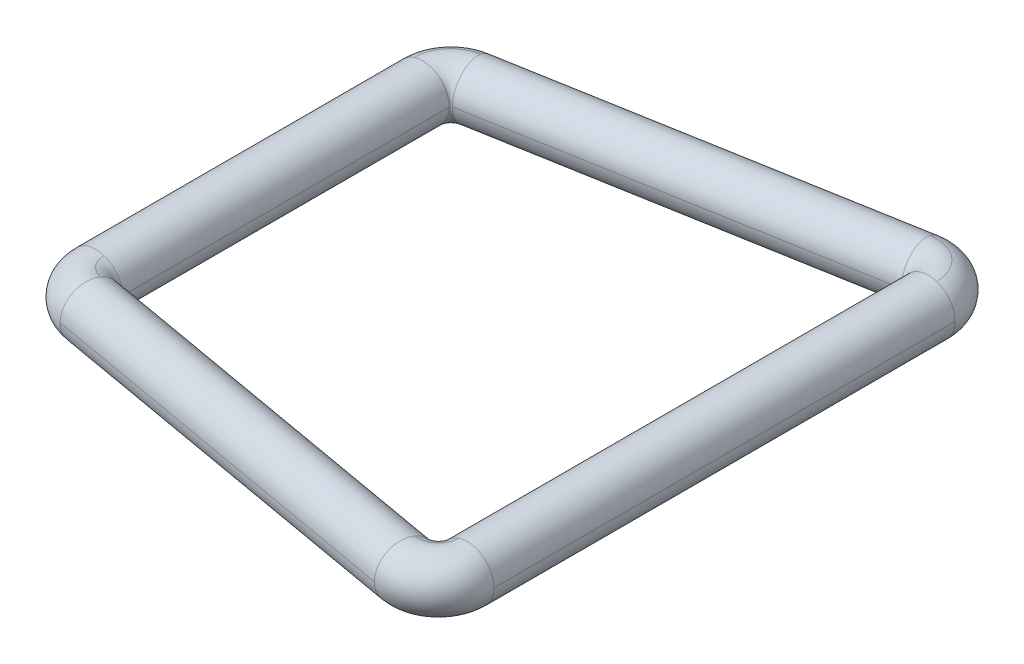
ISO-10303-21;
HEADER;
FILE_DESCRIPTION(('STEP AP214'),'2;1');
FILE_NAME('part.step','',(''),(''),'','','');
FILE_SCHEMA(('AUTOMOTIVE_DESIGN { 1 0 10303 214 1 1 1 1 }'));
ENDSEC;
DATA;
#1=APPLICATION_CONTEXT('core data for automotive mechanical design processes');
#2=APPLICATION_PROTOCOL_DEFINITION('international standard','automotive_design',2000,#1);
#3=PRODUCT_CONTEXT('',#1,'mechanical');
#4=PRODUCT('Part','Part','',(#3));
#5=PRODUCT_RELATED_PRODUCT_CATEGORY('part','',(#4));
#6=PRODUCT_DEFINITION_FORMATION('','',#4);
#7=PRODUCT_DEFINITION_CONTEXT('part definition',#1,'design');
#8=PRODUCT_DEFINITION('design','',#6,#7);
#9=PRODUCT_DEFINITION_SHAPE('','',#8);
#10=(LENGTH_UNIT() NAMED_UNIT(*) SI_UNIT(.MILLI.,.METRE.));
#11=(NAMED_UNIT(*) PLANE_ANGLE_UNIT() SI_UNIT($,.RADIAN.));
#12=(NAMED_UNIT(*) SI_UNIT($,.STERADIAN.) SOLID_ANGLE_UNIT());
#13=UNCERTAINTY_MEASURE_WITH_UNIT(LENGTH_MEASURE(1.E-05),#10,'distance_accuracy_value','');
#14=(GEOMETRIC_REPRESENTATION_CONTEXT(3) GLOBAL_UNCERTAINTY_ASSIGNED_CONTEXT((#13)) GLOBAL_UNIT_ASSIGNED_CONTEXT((#10,
#11,#12)) REPRESENTATION_CONTEXT('',''));
#15=CARTESIAN_POINT('',(0.,0.,0.));
#16=DIRECTION('',(0.,0.,1.));
#17=DIRECTION('',(1.,0.,0.));
#18=AXIS2_PLACEMENT_3D('',#15,#16,#17);
#19=CARTESIAN_POINT('',(13.36,0.,12.9));
#20=DIRECTION('',(0.,0.,-1.));
#21=DIRECTION('',(0.,1.,0.));
#22=AXIS2_PLACEMENT_3D('',#19,#20,#21);
#23=CYLINDRICAL_SURFACE('',#22,1.5);
#24=DIRECTION('',(0.,0.,-1.));
#25=VECTOR('',#24,1.);
#26=CARTESIAN_POINT('',(14.86,0.,12.9));
#27=LINE('',#26,#25);
#28=CARTESIAN_POINT('',(14.86,0.,12.9));
#29=VERTEX_POINT('',#28);
#30=CARTESIAN_POINT('',(14.86,0.,-12.9));
#31=VERTEX_POINT('',#30);
#32=EDGE_CURVE('E11',#29,#31,#27,.T.);
#33=ORIENTED_EDGE('',*,*,#32,.F.);
#34=CARTESIAN_POINT('',(13.36,0.,12.9));
#35=DIRECTION('',(0.,0.,1.));
#36=DIRECTION('',(1.,0.,0.));
#37=AXIS2_PLACEMENT_3D('',#34,#35,#36);
#38=CIRCLE('',#37,1.5);
#39=CARTESIAN_POINT('',(13.8235254915624,-1.42658477444273,12.9));
#40=VERTEX_POINT('',#39);
#41=EDGE_CURVE('E26',#40,#29,#38,.T.);
#42=ORIENTED_EDGE('',*,*,#41,.F.);
#43=CARTESIAN_POINT('',(13.36,0.,12.9));
#44=DIRECTION('',(0.,0.,1.));
#45=DIRECTION('',(1.,0.,0.));
#46=AXIS2_PLACEMENT_3D('',#43,#44,#45);
#47=CIRCLE('',#46,1.5);
#48=CARTESIAN_POINT('',(11.86,0.,12.9));
#49=VERTEX_POINT('',#48);
#50=EDGE_CURVE('E572',#49,#40,#47,.T.);
#51=ORIENTED_EDGE('',*,*,#50,.F.);
#52=DIRECTION('',(0.,0.,-1.));
#53=VECTOR('',#52,1.);
#54=CARTESIAN_POINT('',(11.86,0.,12.9));
#55=LINE('',#54,#53);
#56=CARTESIAN_POINT('',(11.86,0.,-12.9));
#57=VERTEX_POINT('',#56);
#58=EDGE_CURVE('E567',#49,#57,#55,.T.);
#59=ORIENTED_EDGE('',*,*,#58,.T.);
#60=CARTESIAN_POINT('',(13.36,0.,-12.9));
#61=DIRECTION('',(0.,0.,1.));
#62=DIRECTION('',(1.,0.,0.));
#63=AXIS2_PLACEMENT_3D('',#60,#61,#62);
#64=CIRCLE('',#63,1.5);
#65=CARTESIAN_POINT('',(12.8964745084376,-1.42658477444273,-12.9));
#66=VERTEX_POINT('',#65);
#67=EDGE_CURVE('E554',#57,#66,#64,.T.);
#68=ORIENTED_EDGE('',*,*,#67,.T.);
#69=CARTESIAN_POINT('',(13.36,0.,-12.9));
#70=DIRECTION('',(0.,0.,1.));
#71=DIRECTION('',(1.,0.,0.));
#72=AXIS2_PLACEMENT_3D('',#69,#70,#71);
#73=CIRCLE('',#72,1.5);
#74=EDGE_CURVE('E549',#66,#31,#73,.T.);
#75=ORIENTED_EDGE('',*,*,#74,.T.);
#76=EDGE_LOOP('',(#33,#42,#51,#59,#68,#75));
#77=FACE_BOUND('',#76,.T.);
#78=ADVANCED_FACE('F17',(#77),#23,.T.);
#79=CARTESIAN_POINT('',(11.76,0.,-12.9));
#80=DIRECTION('',(0.,1.,0.));
#81=DIRECTION('',(-0.642787609686501,0.,0.766044443119011));
#82=AXIS2_PLACEMENT_3D('',#79,#80,#81);
#83=TOROIDAL_SURFACE('',#82,1.6,1.5);
#84=CARTESIAN_POINT('',(11.76,-1.42658477444273,-12.9));
#85=DIRECTION('',(0.,1.,0.));
#86=DIRECTION('',(1.,0.,0.));
#87=AXIS2_PLACEMENT_3D('',#84,#85,#86);
#88=CIRCLE('',#87,1.13647450843758);
#89=CARTESIAN_POINT('',(11.5626532726448,-1.42658477444273,-14.01920890701));
#90=VERTEX_POINT('',#89);
#91=EDGE_CURVE('E547',#66,#90,#88,.T.);
#92=ORIENTED_EDGE('',*,*,#91,.T.);
#93=CARTESIAN_POINT('',(11.4821629157329,0.,-14.4756924048195));
#94=DIRECTION('',(-0.984807753012208,0.,0.17364817766693));
#95=DIRECTION('',(0.17364817766693,0.,0.984807753012208));
#96=AXIS2_PLACEMENT_3D('',#93,#94,#95);
#97=CIRCLE('',#96,1.5);
#98=CARTESIAN_POINT('',(11.2216906492324,0.,-15.9529040343383));
#99=VERTEX_POINT('',#98);
#100=EDGE_CURVE('E169',#99,#90,#97,.T.);
#101=ORIENTED_EDGE('',*,*,#100,.F.);
#102=CARTESIAN_POINT('',(11.4821629157329,0.,-14.4756924048195));
#103=DIRECTION('',(-0.984807753012208,0.,0.17364817766693));
#104=DIRECTION('',(0.17364817766693,0.,0.984807753012208));
#105=AXIS2_PLACEMENT_3D('',#102,#103,#104);
#106=CIRCLE('',#105,1.5);
#107=CARTESIAN_POINT('',(11.4016725588207,1.42658477444273,-14.932175902629));
#108=VERTEX_POINT('',#107);
#109=EDGE_CURVE('E556',#108,#99,#106,.T.);
#110=ORIENTED_EDGE('',*,*,#109,.F.);
#111=CARTESIAN_POINT('',(13.8235254915624,1.42658477444273,-12.9));
#112=CARTESIAN_POINT('',(13.823526582896,1.42658477444273,-12.9375160098481));
#113=CARTESIAN_POINT('',(13.8225024414523,1.42658477444273,-12.975031916497));
#114=CARTESIAN_POINT('',(13.8184115299439,1.42658477444273,-13.0499522110827));
#115=CARTESIAN_POINT('',(13.8153447598793,1.42658477444273,-13.0873565990196));
#116=CARTESIAN_POINT('',(13.8071764280626,1.42658477444273,-13.1619425438679));
#117=CARTESIAN_POINT('',(13.8020748663106,1.42658477444273,-13.1991241007793));
#118=CARTESIAN_POINT('',(13.7898524673639,1.42658477444273,-13.2731538228404));
#119=CARTESIAN_POINT('',(13.7827316301691,1.42658477444273,-13.3100019879901));
#120=CARTESIAN_POINT('',(13.7664917658361,1.42658477444273,-13.3832553335004));
#121=CARTESIAN_POINT('',(13.7573727386978,1.42658477444273,-13.419660513861));
#122=CARTESIAN_POINT('',(13.7371636395456,1.42658477444273,-13.4919196206017));
#123=CARTESIAN_POINT('',(13.7260735675316,1.42658477444273,-13.5277735469817));
#124=CARTESIAN_POINT('',(13.7019553543517,1.42658477444273,-13.5988235143129));
#125=CARTESIAN_POINT('',(13.6889272131858,1.42658477444273,-13.6340195552639));
#126=CARTESIAN_POINT('',(13.6609716097157,1.42658477444273,-13.7036490773255));
#127=CARTESIAN_POINT('',(13.6460441474116,1.42658477444273,-13.738082558436));
#128=CARTESIAN_POINT('',(13.6143342960917,1.42658477444273,-13.8060845541675));
#129=CARTESIAN_POINT('',(13.5975519070759,1.42658477444273,-13.8396530687884));
#130=CARTESIAN_POINT('',(13.5621821139917,1.42658477444273,-13.9058252973712));
#131=CARTESIAN_POINT('',(13.5435947099233,1.42658477444273,-13.9384290113331));
#132=CARTESIAN_POINT('',(13.5046701664225,1.42658477444273,-14.0025746737773));
#133=CARTESIAN_POINT('',(13.4843330269901,1.42658477444273,-14.0341166222596));
#134=CARTESIAN_POINT('',(13.4419694962796,1.42658477444273,-14.0960449466619));
#135=CARTESIAN_POINT('',(13.4199431050015,1.42658477444273,-14.1264313225818));
#136=CARTESIAN_POINT('',(13.3742665780127,1.42658477444273,-14.1859581314973));
#137=CARTESIAN_POINT('',(13.350616442302,1.42658477444273,-14.2150985644928));
#138=CARTESIAN_POINT('',(13.3017627629483,1.42658477444273,-14.2720468226844));
#139=CARTESIAN_POINT('',(13.2765592193053,1.42658477444273,-14.2998546478804));
#140=CARTESIAN_POINT('',(13.2246736804873,1.42658477444273,-14.3540549888296));
#141=CARTESIAN_POINT('',(13.1979916853122,1.42658477444273,-14.3804475045827));
#142=CARTESIAN_POINT('',(13.1432285968077,1.42658477444273,-14.4317387341925));
#143=CARTESIAN_POINT('',(13.1151475034782,1.42658477444273,-14.4566374480492));
#144=CARTESIAN_POINT('',(13.057669733019,1.42658477444273,-14.5048670240424));
#145=CARTESIAN_POINT('',(13.0282730558893,1.42658477444273,-14.5281978861789));
#146=CARTESIAN_POINT('',(12.9682515447858,1.42658477444273,-14.573222371765));
#147=CARTESIAN_POINT('',(12.937626710812,1.42658477444273,-14.5949159952147));
#148=CARTESIAN_POINT('',(12.8752399655663,1.42658477444273,-14.6366014856771));
#149=CARTESIAN_POINT('',(12.8434780542945,1.42658477444273,-14.6565933526899));
#150=CARTESIAN_POINT('',(12.7789116157148,1.42658477444273,-14.6948158736244));
#151=CARTESIAN_POINT('',(12.7461070884069,1.42658477444273,-14.713046527546));
#152=CARTESIAN_POINT('',(12.6795529798011,1.42658477444273,-14.7476924035647));
#153=CARTESIAN_POINT('',(12.6458033985032,1.42658477444273,-14.7641076256618));
#154=CARTESIAN_POINT('',(12.5774595545933,1.42658477444273,-14.7950738184721));
#155=CARTESIAN_POINT('',(12.5428652919814,1.42658477444273,-14.8096247891852));
#156=CARTESIAN_POINT('',(12.4729349702389,1.42658477444273,-14.8368192040186));
#157=CARTESIAN_POINT('',(12.4375989111082,1.42658477444273,-14.8494626481388));
#158=CARTESIAN_POINT('',(12.3662900872523,1.42658477444273,-14.872804407685));
#159=CARTESIAN_POINT('',(12.330317322527,1.42658477444273,-14.8835027231109));
#160=CARTESIAN_POINT('',(12.2578420720145,1.42658477444273,-14.9029224079012));
#161=CARTESIAN_POINT('',(12.2213395862273,1.42658477444273,-14.9116437772655));
#162=CARTESIAN_POINT('',(12.1479134534644,1.42658477444273,-14.9270836326851));
#163=CARTESIAN_POINT('',(12.1109898064886,1.42658477444273,-14.9338021187404));
#164=CARTESIAN_POINT('',(12.0368311640424,1.42658477444273,-14.9452162247184));
#165=CARTESIAN_POINT('',(11.9995961685719,1.42658477444273,-14.9499118446411));
#166=CARTESIAN_POINT('',(11.9249255667879,1.42658477444273,-14.9572662599623));
#167=CARTESIAN_POINT('',(11.8874899604743,1.42658477444273,-14.9599250553607));
#168=CARTESIAN_POINT('',(11.8125294750347,1.42658477444273,-14.9631978897079));
#169=CARTESIAN_POINT('',(11.7750045959087,1.42658477444273,-14.9638119286566));
#170=CARTESIAN_POINT('',(11.6999771543658,1.42658477444273,-14.9629935155706));
#171=CARTESIAN_POINT('',(11.6624745919489,1.42658477444273,-14.961561063536));
#172=CARTESIAN_POINT('',(11.587603359262,1.42658477444273,-14.9566535866357));
#173=CARTESIAN_POINT('',(11.550234688992,1.42658477444273,-14.9531785617701));
#174=CARTESIAN_POINT('',(11.4757422226976,1.42658477444273,-14.9441975505154));
#175=CARTESIAN_POINT('',(11.4386184266731,1.42658477444273,-14.9386915641262));
#176=CARTESIAN_POINT('',(11.4016725588207,1.42658477444273,-14.932175902629));
#177=B_SPLINE_CURVE_WITH_KNOTS('',3,(#111,#112,#113,#114,#115,#116,#117,#118,#119,#120,#121,
#122,#123,#124,#125,#126,#127,#128,#129,#130,#131,#132,#133,#134,#135,#136,#137,#138,#139,#140,
#141,#142,#143,#144,#145,#146,#147,#148,#149,#150,#151,#152,#153,#154,#155,#156,#157,#158,#159,
#160,#161,#162,#163,#164,#165,#166,#167,#168,#169,#170,#171,#172,#173,#174,#175,#176),
.UNSPECIFIED.,.F.,.F.,(4,2,2,2,2,2,2,2,2,2,2,2,2,2,2,2,2,2,2,2,2,2,2,2,2,2,2,2,2,2,2,2,4),(0.,
0.112533906641242,0.225067813282482,0.337601719923726,0.450135626564966,0.562669533206208,
0.675203439847451,0.787737346488693,0.900271253129935,1.01280515977118,1.12533906641242,
1.23787297305366,1.3504068796949,1.46294078633614,1.57547469297739,1.68800859961863,
1.80054250625987,1.91307641290111,2.02561031954235,2.13814422618359,2.25067813282483,
2.36321203946608,2.47574594610732,2.58827985274856,2.7008137593898,2.81334766603104,
2.92588157267229,3.03841547931353,3.15094938595477,3.26348329259601,3.37601719923725,
3.48855110587849,3.60108501251973),.UNSPECIFIED.);
#178=CARTESIAN_POINT('',(13.8235254915624,1.42658477444273,-12.9));
#179=VERTEX_POINT('',#178);
#180=EDGE_CURVE('E180',#179,#108,#177,.T.);
#181=ORIENTED_EDGE('',*,*,#180,.F.);
#182=CARTESIAN_POINT('',(13.36,0.,-12.9));
#183=DIRECTION('',(0.,0.,1.));
#184=DIRECTION('',(1.,0.,0.));
#185=AXIS2_PLACEMENT_3D('',#182,#183,#184);
#186=CIRCLE('',#185,1.5);
#187=EDGE_CURVE('E517',#31,#179,#186,.T.);
#188=ORIENTED_EDGE('',*,*,#187,.F.);
#189=ORIENTED_EDGE('',*,*,#74,.F.);
#190=EDGE_LOOP('',(#92,#101,#110,#181,#188,#189));
#191=FACE_BOUND('',#190,.T.);
#192=ADVANCED_FACE('F529',(#191),#83,.T.);
#193=CARTESIAN_POINT('',(13.36,0.,12.9));
#194=DIRECTION('',(0.,0.,-1.));
#195=DIRECTION('',(0.,-1.,0.));
#196=AXIS2_PLACEMENT_3D('',#193,#194,#195);
#197=CYLINDRICAL_SURFACE('',#196,1.5);
#198=ORIENTED_EDGE('',*,*,#32,.T.);
#199=ORIENTED_EDGE('',*,*,#187,.T.);
#200=CARTESIAN_POINT('',(13.36,0.,-12.9));
#201=DIRECTION('',(0.,0.,1.));
#202=DIRECTION('',(1.,0.,0.));
#203=AXIS2_PLACEMENT_3D('',#200,#201,#202);
#204=CIRCLE('',#203,1.5);
#205=EDGE_CURVE('E511',#179,#57,#204,.T.);
#206=ORIENTED_EDGE('',*,*,#205,.T.);
#207=ORIENTED_EDGE('',*,*,#58,.F.);
#208=CARTESIAN_POINT('',(13.36,0.,12.9));
#209=DIRECTION('',(0.,0.,1.));
#210=DIRECTION('',(1.,0.,0.));
#211=AXIS2_PLACEMENT_3D('',#208,#209,#210);
#212=CIRCLE('',#211,1.5);
#213=CARTESIAN_POINT('',(12.8964745084376,1.42658477444273,12.9));
#214=VERTEX_POINT('',#213);
#215=EDGE_CURVE('E505',#214,#49,#212,.T.);
#216=ORIENTED_EDGE('',*,*,#215,.F.);
#217=CARTESIAN_POINT('',(13.36,0.,12.9));
#218=DIRECTION('',(0.,0.,1.));
#219=DIRECTION('',(1.,0.,0.));
#220=AXIS2_PLACEMENT_3D('',#217,#218,#219);
#221=CIRCLE('',#220,1.5);
#222=EDGE_CURVE('E499',#29,#214,#221,.T.);
#223=ORIENTED_EDGE('',*,*,#222,.F.);
#224=EDGE_LOOP('',(#198,#199,#206,#207,#216,#223));
#225=FACE_BOUND('',#224,.T.);
#226=ADVANCED_FACE('F472',(#225),#197,.T.);
#227=CARTESIAN_POINT('',(11.76,0.,12.9));
#228=DIRECTION('',(0.,-1.,0.));
#229=DIRECTION('',(-0.642787609686538,0.,-0.766044443118979));
#230=AXIS2_PLACEMENT_3D('',#227,#228,#229);
#231=TOROIDAL_SURFACE('',#230,1.6,1.5);
#232=CARTESIAN_POINT('',(11.76,1.42658477444273,12.9));
#233=DIRECTION('',(0.,-1.,0.));
#234=DIRECTION('',(1.,0.,0.));
#235=AXIS2_PLACEMENT_3D('',#232,#233,#234);
#236=CIRCLE('',#235,1.13647450843758);
#237=CARTESIAN_POINT('',(11.5626532726449,1.42658477444273,14.0192089070101));
#238=VERTEX_POINT('',#237);
#239=EDGE_CURVE('E494',#214,#238,#236,.T.);
#240=ORIENTED_EDGE('',*,*,#239,.T.);
#241=CARTESIAN_POINT('',(11.4821629157329,0.,14.4756924048195));
#242=DIRECTION('',(-0.984807753012208,0.,-0.17364817766693));
#243=DIRECTION('',(-0.17364817766693,0.,0.984807753012208));
#244=AXIS2_PLACEMENT_3D('',#241,#242,#243);
#245=CIRCLE('',#244,1.5);
#246=CARTESIAN_POINT('',(11.2216906492325,0.,15.9529040343379));
#247=VERTEX_POINT('',#246);
#248=EDGE_CURVE('E488',#247,#238,#245,.T.);
#249=ORIENTED_EDGE('',*,*,#248,.F.);
#250=CARTESIAN_POINT('',(11.4821629157329,0.,14.4756924048195));
#251=DIRECTION('',(-0.984807753012208,0.,-0.17364817766693));
#252=DIRECTION('',(-0.17364817766693,0.,0.984807753012208));
#253=AXIS2_PLACEMENT_3D('',#250,#251,#252);
#254=CIRCLE('',#253,1.5);
#255=CARTESIAN_POINT('',(11.4016725588209,-1.42658477444273,14.932175902629));
#256=VERTEX_POINT('',#255);
#257=EDGE_CURVE('E484',#256,#247,#254,.T.);
#258=ORIENTED_EDGE('',*,*,#257,.F.);
#259=CARTESIAN_POINT('',(13.8235254915624,-1.42658477444273,12.9));
#260=CARTESIAN_POINT('',(13.823526582896,-1.42658477444273,12.9375160098481));
#261=CARTESIAN_POINT('',(13.8225024414523,-1.42658477444273,12.975031916497));
#262=CARTESIAN_POINT('',(13.8184115299439,-1.42658477444273,13.0499522110827));
#263=CARTESIAN_POINT('',(13.8153447598793,-1.42658477444273,13.0873565990196));
#264=CARTESIAN_POINT('',(13.8071764280626,-1.42658477444273,13.1619425438679));
#265=CARTESIAN_POINT('',(13.8020748663106,-1.42658477444273,13.1991241007793));
#266=CARTESIAN_POINT('',(13.7898524673639,-1.42658477444273,13.2731538228404));
#267=CARTESIAN_POINT('',(13.7827316301691,-1.42658477444273,13.3100019879901));
#268=CARTESIAN_POINT('',(13.7664917658361,-1.42658477444273,13.3832553335003));
#269=CARTESIAN_POINT('',(13.7573727386978,-1.42658477444273,13.4196605138609));
#270=CARTESIAN_POINT('',(13.7371636395456,-1.42658477444273,13.4919196206016));
#271=CARTESIAN_POINT('',(13.7260735675316,-1.42658477444273,13.5277735469817));
#272=CARTESIAN_POINT('',(13.7019553543517,-1.42658477444273,13.5988235143128));
#273=CARTESIAN_POINT('',(13.6889272131858,-1.42658477444273,13.6340195552639));
#274=CARTESIAN_POINT('',(13.6609716097157,-1.42658477444273,13.7036490773255));
#275=CARTESIAN_POINT('',(13.6460441474116,-1.42658477444273,13.738082558436));
#276=CARTESIAN_POINT('',(13.6143342960917,-1.42658477444273,13.8060845541675));
#277=CARTESIAN_POINT('',(13.5975519070759,-1.42658477444273,13.8396530687884));
#278=CARTESIAN_POINT('',(13.5621821139917,-1.42658477444273,13.9058252973712));
#279=CARTESIAN_POINT('',(13.5435947099233,-1.42658477444273,13.938429011333));
#280=CARTESIAN_POINT('',(13.5046701664225,-1.42658477444273,14.0025746737772));
#281=CARTESIAN_POINT('',(13.4843330269901,-1.42658477444273,14.0341166222595));
#282=CARTESIAN_POINT('',(13.4419694962796,-1.42658477444273,14.0960449466618));
#283=CARTESIAN_POINT('',(13.4199431050016,-1.42658477444273,14.1264313225817));
#284=CARTESIAN_POINT('',(13.3742665780128,-1.42658477444273,14.1859581314972));
#285=CARTESIAN_POINT('',(13.350616442302,-1.42658477444273,14.2150985644927));
#286=CARTESIAN_POINT('',(13.3017627629483,-1.42658477444273,14.2720468226843));
#287=CARTESIAN_POINT('',(13.2765592193053,-1.42658477444273,14.2998546478804));
#288=CARTESIAN_POINT('',(13.2246736804873,-1.42658477444273,14.3540549888295));
#289=CARTESIAN_POINT('',(13.1979916853123,-1.42658477444273,14.3804475045826));
#290=CARTESIAN_POINT('',(13.1432285968078,-1.42658477444273,14.4317387341925));
#291=CARTESIAN_POINT('',(13.1151475034782,-1.42658477444273,14.4566374480492));
#292=CARTESIAN_POINT('',(13.0576697330191,-1.42658477444273,14.5048670240424));
#293=CARTESIAN_POINT('',(13.0282730558894,-1.42658477444273,14.5281978861789));
#294=CARTESIAN_POINT('',(12.9682515447859,-1.42658477444273,14.573222371765));
#295=CARTESIAN_POINT('',(12.937626710812,-1.42658477444273,14.5949159952146));
#296=CARTESIAN_POINT('',(12.8752399655664,-1.42658477444273,14.636601485677));
#297=CARTESIAN_POINT('',(12.8434780542946,-1.42658477444273,14.6565933526899));
#298=CARTESIAN_POINT('',(12.7789116157149,-1.42658477444273,14.6948158736243));
#299=CARTESIAN_POINT('',(12.746107088407,-1.42658477444273,14.7130465275459));
#300=CARTESIAN_POINT('',(12.6795529798012,-1.42658477444273,14.7476924035647));
#301=CARTESIAN_POINT('',(12.6458033985033,-1.42658477444273,14.7641076256618));
#302=CARTESIAN_POINT('',(12.5774595545935,-1.42658477444273,14.795073818472));
#303=CARTESIAN_POINT('',(12.5428652919816,-1.42658477444273,14.8096247891851));
#304=CARTESIAN_POINT('',(12.472934970239,-1.42658477444273,14.8368192040185));
#305=CARTESIAN_POINT('',(12.4375989111083,-1.42658477444273,14.8494626481388));
#306=CARTESIAN_POINT('',(12.3662900872524,-1.42658477444273,14.8728044076849));
#307=CARTESIAN_POINT('',(12.3303173225271,-1.42658477444273,14.8835027231109));
#308=CARTESIAN_POINT('',(12.2578420720147,-1.42658477444273,14.9029224079011));
#309=CARTESIAN_POINT('',(12.2213395862275,-1.42658477444273,14.9116437772654));
#310=CARTESIAN_POINT('',(12.1479134534646,-1.42658477444273,14.9270836326851));
#311=CARTESIAN_POINT('',(12.1109898064888,-1.42658477444273,14.9338021187404));
#312=CARTESIAN_POINT('',(12.0368311640426,-1.42658477444273,14.9452162247184));
#313=CARTESIAN_POINT('',(11.9995961685721,-1.42658477444273,14.9499118446411));
#314=CARTESIAN_POINT('',(11.9249255667881,-1.42658477444273,14.9572662599622));
#315=CARTESIAN_POINT('',(11.8874899604745,-1.42658477444273,14.9599250553607));
#316=CARTESIAN_POINT('',(11.8125294750349,-1.42658477444273,14.9631978897078));
#317=CARTESIAN_POINT('',(11.7750045959089,-1.42658477444273,14.9638119286566));
#318=CARTESIAN_POINT('',(11.699977154366,-1.42658477444273,14.9629935155707));
#319=CARTESIAN_POINT('',(11.6624745919491,-1.42658477444273,14.961561063536));
#320=CARTESIAN_POINT('',(11.5876033592622,-1.42658477444273,14.9566535866358));
#321=CARTESIAN_POINT('',(11.5502346889922,-1.42658477444273,14.9531785617702));
#322=CARTESIAN_POINT('',(11.4757422226978,-1.42658477444273,14.9441975505154));
#323=CARTESIAN_POINT('',(11.4386184266733,-1.42658477444273,14.9386915641262));
#324=CARTESIAN_POINT('',(11.4016725588209,-1.42658477444273,14.932175902629));
#325=B_SPLINE_CURVE_WITH_KNOTS('',3,(#259,#260,#261,#262,#263,#264,#265,#266,#267,#268,#269,
#270,#271,#272,#273,#274,#275,#276,#277,#278,#279,#280,#281,#282,#283,#284,#285,#286,#287,#288,
#289,#290,#291,#292,#293,#294,#295,#296,#297,#298,#299,#300,#301,#302,#303,#304,#305,#306,#307,
#308,#309,#310,#311,#312,#313,#314,#315,#316,#317,#318,#319,#320,#321,#322,#323,#324),
.UNSPECIFIED.,.F.,.F.,(4,2,2,2,2,2,2,2,2,2,2,2,2,2,2,2,2,2,2,2,2,2,2,2,2,2,2,2,2,2,2,2,4),(0.,
0.112533906641235,0.225067813282472,0.337601719923706,0.450135626564943,0.562669533206177,
0.675203439847411,0.787737346488648,0.900271253129883,1.01280515977112,1.12533906641235,
1.23787297305359,1.35040687969483,1.46294078633606,1.5754746929773,1.68800859961853,
1.80054250625977,1.913076412901,2.02561031954224,2.13814422618347,2.25067813282471,
2.36321203946594,2.47574594610718,2.58827985274841,2.70081375938965,2.81334766603088,
2.92588157267212,3.03841547931335,3.15094938595459,3.26348329259582,3.37601719923706,
3.4885511058783,3.60108501251953),.UNSPECIFIED.);
#326=EDGE_CURVE('E450',#40,#256,#325,.T.);
#327=ORIENTED_EDGE('',*,*,#326,.F.);
#328=ORIENTED_EDGE('',*,*,#41,.T.);
#329=ORIENTED_EDGE('',*,*,#222,.T.);
#330=EDGE_LOOP('',(#240,#249,#258,#327,#328,#329));
#331=FACE_BOUND('',#330,.T.);
#332=ADVANCED_FACE('F467',(#331),#231,.T.);
#333=CARTESIAN_POINT('',(11.76,0.,12.9));
#334=DIRECTION('',(0.,-1.,0.));
#335=DIRECTION('',(-0.642787609686538,0.,-0.766044443118979));
#336=AXIS2_PLACEMENT_3D('',#333,#334,#335);
#337=TOROIDAL_SURFACE('',#336,1.6,1.5);
#338=ORIENTED_EDGE('',*,*,#239,.F.);
#339=ORIENTED_EDGE('',*,*,#215,.T.);
#340=ORIENTED_EDGE('',*,*,#50,.T.);
#341=ORIENTED_EDGE('',*,*,#326,.T.);
#342=CARTESIAN_POINT('',(11.4821629157329,0.,14.4756924048195));
#343=DIRECTION('',(-0.984807753012208,0.,-0.17364817766693));
#344=DIRECTION('',(-0.17364817766693,0.,0.984807753012208));
#345=AXIS2_PLACEMENT_3D('',#342,#343,#344);
#346=CIRCLE('',#345,1.5);
#347=CARTESIAN_POINT('',(11.7426351822332,0.,12.9984807753016));
#348=VERTEX_POINT('',#347);
#349=EDGE_CURVE('E444',#348,#256,#346,.T.);
#350=ORIENTED_EDGE('',*,*,#349,.F.);
#351=CARTESIAN_POINT('',(11.4821629157329,0.,14.4756924048195));
#352=DIRECTION('',(-0.984807753012208,0.,-0.17364817766693));
#353=DIRECTION('',(-0.17364817766693,0.,0.984807753012208));
#354=AXIS2_PLACEMENT_3D('',#351,#352,#353);
#355=CIRCLE('',#354,1.5);
#356=EDGE_CURVE('E438',#238,#348,#355,.T.);
#357=ORIENTED_EDGE('',*,*,#356,.F.);
#358=EDGE_LOOP('',(#338,#339,#340,#341,#350,#357));
#359=FACE_BOUND('',#358,.T.);
#360=ADVANCED_FACE('F458',(#359),#337,.T.);
#361=CARTESIAN_POINT('',(-9.85942863439902,0.,10.7125940032719));
#362=DIRECTION('',(0.984807753012208,0.,0.17364817766693));
#363=DIRECTION('',(0.,-1.,0.));
#364=AXIS2_PLACEMENT_3D('',#361,#362,#363);
#365=CYLINDRICAL_SURFACE('',#364,1.5);
#366=DIRECTION('',(0.984807753012208,0.,0.17364817766693));
#367=VECTOR('',#366,1.);
#368=CARTESIAN_POINT('',(-10.1199009008994,0.,12.1898056327903));
#369=LINE('',#368,#367);
#370=CARTESIAN_POINT('',(-10.1199009008994,0.,12.1898056327903));
#371=VERTEX_POINT('',#370);
#372=EDGE_CURVE('E432',#371,#247,#369,.T.);
#373=ORIENTED_EDGE('',*,*,#372,.T.);
#374=ORIENTED_EDGE('',*,*,#248,.T.);
#375=ORIENTED_EDGE('',*,*,#356,.T.);
#376=DIRECTION('',(0.984807753012208,0.,0.17364817766693));
#377=VECTOR('',#376,1.);
#378=CARTESIAN_POINT('',(-9.59895636789862,0.,9.23538237375363));
#379=LINE('',#378,#377);
#380=CARTESIAN_POINT('',(-9.59895636789862,0.,9.23538237375363));
#381=VERTEX_POINT('',#380);
#382=EDGE_CURVE('E426',#381,#348,#379,.T.);
#383=ORIENTED_EDGE('',*,*,#382,.F.);
#384=CARTESIAN_POINT('',(-9.85942863439902,0.,10.7125940032719));
#385=DIRECTION('',(-0.984807753012208,0.,-0.17364817766693));
#386=DIRECTION('',(-0.17364817766693,0.,0.984807753012208));
#387=AXIS2_PLACEMENT_3D('',#384,#385,#386);
#388=CIRCLE('',#387,1.5);
#389=CARTESIAN_POINT('',(-9.77893827748703,1.42658477444273,10.2561105054615));
#390=VERTEX_POINT('',#389);
#391=EDGE_CURVE('E417',#390,#381,#388,.T.);
#392=ORIENTED_EDGE('',*,*,#391,.F.);
#393=CARTESIAN_POINT('',(-9.85942863439902,0.,10.7125940032719));
#394=DIRECTION('',(-0.984807753012208,0.,-0.17364817766693));
#395=DIRECTION('',(-0.17364817766693,0.,0.984807753012208));
#396=AXIS2_PLACEMENT_3D('',#393,#394,#395);
#397=CIRCLE('',#396,1.5);
#398=EDGE_CURVE('E413',#371,#390,#397,.T.);
#399=ORIENTED_EDGE('',*,*,#398,.F.);
#400=EDGE_LOOP('',(#373,#374,#375,#383,#392,#399));
#401=FACE_BOUND('',#400,.T.);
#402=ADVANCED_FACE('F386',(#401),#365,.T.);
#403=CARTESIAN_POINT('',(-9.58159155013201,0.,9.13690159845146));
#404=DIRECTION('',(0.,-1.,0.));
#405=DIRECTION('',(0.766044443118953,0.,-0.642787609686569));
#406=AXIS2_PLACEMENT_3D('',#403,#404,#405);
#407=TOROIDAL_SURFACE('',#406,1.6,1.5);
#408=CARTESIAN_POINT('',(-9.58159155013201,1.42658477444273,9.13690159845146));
#409=DIRECTION('',(0.,-1.,0.));
#410=DIRECTION('',(-0.173648177666853,0.,0.984807753012222));
#411=AXIS2_PLACEMENT_3D('',#408,#409,#410);
#412=CIRCLE('',#411,1.13647450843758);
#413=CARTESIAN_POINT('',(-10.7180660585696,1.42658477444273,9.13690159845146));
#414=VERTEX_POINT('',#413);
#415=EDGE_CURVE('E409',#390,#414,#412,.T.);
#416=ORIENTED_EDGE('',*,*,#415,.T.);
#417=CARTESIAN_POINT('',(-11.181597,0.,9.13690159845147));
#418=DIRECTION('',(0.,0.,-1.));
#419=DIRECTION('',(-1.,0.,0.));
#420=AXIS2_PLACEMENT_3D('',#417,#418,#419);
#421=CIRCLE('',#420,1.5);
#422=CARTESIAN_POINT('',(-12.681591550132,0.,9.13690159845147));
#423=VERTEX_POINT('',#422);
#424=EDGE_CURVE('E315',#423,#414,#421,.T.);
#425=ORIENTED_EDGE('',*,*,#424,.F.);
#426=CARTESIAN_POINT('',(-11.181597,0.,9.13690159845147));
#427=DIRECTION('',(0.,0.,-1.));
#428=DIRECTION('',(-0.309013717670645,-0.951057580954679,0.));
#429=AXIS2_PLACEMENT_3D('',#426,#427,#428);
#430=CIRCLE('',#429,1.5);
#431=CARTESIAN_POINT('',(-11.6451170416944,-1.42658477444273,9.13690159845146));
#432=VERTEX_POINT('',#431);
#433=EDGE_CURVE('E403',#432,#423,#430,.T.);
#434=ORIENTED_EDGE('',*,*,#433,.F.);
#435=CARTESIAN_POINT('',(-9.93991899131093,-1.42658477444273,11.1690775010805));
#436=CARTESIAN_POINT('',(-9.96947588801089,-1.42658477444273,11.1638662768757));
#437=CARTESIAN_POINT('',(-9.99891889803068,-1.42658477444273,11.1580093639874));
#438=CARTESIAN_POINT('',(-10.0575215237235,-1.42658477444273,11.1450172289208));
#439=CARTESIAN_POINT('',(-10.0866811393964,-1.42658477444273,11.1378820067424));
#440=CARTESIAN_POINT('',(-10.1446613554091,-1.42658477444273,11.1223463211726));
#441=CARTESIAN_POINT('',(-10.1734819557488,-1.42658477444273,11.113945857781));
#442=CARTESIAN_POINT('',(-10.2307293099904,-1.42658477444273,11.0958958183303));
#443=CARTESIAN_POINT('',(-10.2591560638924,-1.42658477444273,11.086246242271));
#444=CARTESIAN_POINT('',(-10.3155616051321,-1.42658477444273,11.0657163090816));
#445=CARTESIAN_POINT('',(-10.3435403924697,-1.42658477444273,11.0548359519515));
#446=CARTESIAN_POINT('',(-10.398996743562,-1.42658477444273,11.0318651778911));
#447=CARTESIAN_POINT('',(-10.4264743073166,-1.42658477444273,11.0197747609609));
#448=CARTESIAN_POINT('',(-10.4808759055507,-1.42658477444273,10.9944068794454));
#449=CARTESIAN_POINT('',(-10.5077999400302,-1.42658477444273,10.9811294148602));
#450=CARTESIAN_POINT('',(-10.5610432284418,-1.42658477444273,10.9534127131534));
#451=CARTESIAN_POINT('',(-10.5873624823738,-1.42658477444273,10.9389734760319));
#452=CARTESIAN_POINT('',(-10.6393461094524,-1.42658477444273,10.9089607149708));
#453=CARTESIAN_POINT('',(-10.665010482599,-1.42658477444273,10.8933871910312));
#454=CARTESIAN_POINT('',(-10.7156354945251,-1.42658477444273,10.861135501473));
#455=CARTESIAN_POINT('',(-10.7405961333047,-1.42658477444273,10.8444573358543));
#456=CARTESIAN_POINT('',(-10.789766162499,-1.42658477444273,10.8100281107604));
#457=CARTESIAN_POINT('',(-10.8139755529138,-1.42658477444273,10.7922770512851));
#458=CARTESIAN_POINT('',(-10.861597001429,-1.42658477444273,10.7557358286323));
#459=CARTESIAN_POINT('',(-10.8850090595293,-1.42658477444273,10.7369456654547));
#460=CARTESIAN_POINT('',(-10.9309912772319,-1.42658477444273,10.6983620035398));
#461=CARTESIAN_POINT('',(-10.9535614368342,-1.42658477444273,10.6785685048026));
#462=CARTESIAN_POINT('',(-10.9978168939594,-1.42658477444273,10.6380158498184));
#463=CARTESIAN_POINT('',(-11.0195021914822,-1.42658477444273,10.6172566935715));
#464=CARTESIAN_POINT('',(-11.0619466452519,-1.42658477444273,10.5748122398018));
#465=CARTESIAN_POINT('',(-11.0827058014988,-1.42658477444273,10.553126942279));
#466=CARTESIAN_POINT('',(-11.123258456483,-1.42658477444273,10.5088714851538));
#467=CARTESIAN_POINT('',(-11.1430519552202,-1.42658477444273,10.4863013255515));
#468=CARTESIAN_POINT('',(-11.1816356171352,-1.42658477444273,10.4403191078489));
#469=CARTESIAN_POINT('',(-11.2004257803129,-1.42658477444273,10.4169070497486));
#470=CARTESIAN_POINT('',(-11.2369670029653,-1.42658477444273,10.3692856012334));
#471=CARTESIAN_POINT('',(-11.25471806244,-1.42658477444273,10.3450762108184));
#472=CARTESIAN_POINT('',(-11.2891472875356,-1.42658477444273,10.2959061816244));
#473=CARTESIAN_POINT('',(-11.3058254531565,-1.42658477444273,10.2709455428454));
#474=CARTESIAN_POINT('',(-11.3380771427086,-1.42658477444273,10.2203205309179));
#475=CARTESIAN_POINT('',(-11.3536506666397,-1.42658477444273,10.1946561577695));
#476=CARTESIAN_POINT('',(-11.3836634277239,-1.42658477444273,10.142672530696));
#477=CARTESIAN_POINT('',(-11.398102664877,-1.42658477444273,10.116353276771));
#478=CARTESIAN_POINT('',(-11.4258193664975,-1.42658477444273,10.0631099883402));
#479=CARTESIAN_POINT('',(-11.439096830965,-1.42658477444273,10.0361859538345));
#480=CARTESIAN_POINT('',(-11.4644647128023,-1.42658477444273,9.981784355672));
#481=CARTESIAN_POINT('',(-11.4765551301721,-1.42658477444273,9.95430679201528));
#482=CARTESIAN_POINT('',(-11.4995259030315,-1.42658477444273,9.89885044065564));
#483=CARTESIAN_POINT('',(-11.510406258521,-1.42658477444273,9.87087165295272));
#484=CARTESIAN_POINT('',(-11.5309361961926,-1.42658477444273,9.81446611271097));
#485=CARTESIAN_POINT('',(-11.5405857783746,-1.42658477444273,9.78603936017216));
#486=CARTESIAN_POINT('',(-11.5586358010977,-1.42658477444273,9.72879200220627));
#487=CARTESIAN_POINT('',(-11.5670362416388,-1.42658477444273,9.6999713967792));
#488=CARTESIAN_POINT('',(-11.5825719896372,-1.42658477444273,9.64199119466556));
#489=CARTESIAN_POINT('',(-11.5897072970945,-1.42658477444273,9.61283159797899));
#490=CARTESIAN_POINT('',(-11.6026991991747,-1.42658477444273,9.55422892041438));
#491=CARTESIAN_POINT('',(-11.6085557937974,-1.42658477444273,9.52478583953635));
#492=CARTESIAN_POINT('',(-11.6189791117246,-1.42658477444273,9.46567223972474));
#493=CARTESIAN_POINT('',(-11.6235458350289,-1.42658477444273,9.43600172079115));
#494=CARTESIAN_POINT('',(-11.6313807550819,-1.42658477444273,9.37648972603709));
#495=CARTESIAN_POINT('',(-11.6346489518305,-1.42658477444273,9.34664825021662));
#496=CARTESIAN_POINT('',(-11.6398804565768,-1.42658477444273,9.28685114047801));
#497=CARTESIAN_POINT('',(-11.6418437645744,-1.42658477444273,9.25689550655989));
#498=CARTESIAN_POINT('',(-11.6444622807582,-1.42658477444273,9.19692712585245));
#499=CARTESIAN_POINT('',(-11.6451174889443,-1.42658477444273,9.16691437906313));
#500=CARTESIAN_POINT('',(-11.6451170416944,-1.42658477444273,9.13690159845146));
#501=B_SPLINE_CURVE_WITH_KNOTS('',3,(#435,#436,#437,#438,#439,#440,#441,#442,#443,#444,#445,
#446,#447,#448,#449,#450,#451,#452,#453,#454,#455,#456,#457,#458,#459,#460,#461,#462,#463,#464,
#465,#466,#467,#468,#469,#470,#471,#472,#473,#474,#475,#476,#477,#478,#479,#480,#481,#482,#483,
#484,#485,#486,#487,#488,#489,#490,#491,#492,#493,#494,#495,#496,#497,#498,#499,#500),
.UNSPECIFIED.,.F.,.F.,(4,2,2,2,2,2,2,2,2,2,2,2,2,2,2,2,2,2,2,2,2,2,2,2,2,2,2,2,2,2,2,2,4),(0.,
0.0900311427286447,0.180062285457291,0.270093428185937,0.360124570914584,0.450155713643228,
0.540186856371874,0.630217999100522,0.720249141829167,0.810280284557811,0.900311427286458,
0.990342570015103,1.08037371274375,1.1704048554724,1.26043599820104,1.35046714092969,
1.44049828365833,1.53052942638698,1.62056056911563,1.71059171184427,1.80062285457292,
1.89065399730156,1.98068514003021,2.07071628275885,2.1607474254875,2.25077856821615,
2.34080971094479,2.43084085367344,2.52087199640208,2.61090313913073,2.70093428185937,
2.79096542458802,2.88099656731667),.UNSPECIFIED.);
#502=CARTESIAN_POINT('',(-9.93991899131092,-1.42658477444273,11.1690775010805));
#503=VERTEX_POINT('',#502);
#504=EDGE_CURVE('E359',#503,#432,#501,.T.);
#505=ORIENTED_EDGE('',*,*,#504,.F.);
#506=CARTESIAN_POINT('',(-9.85942863439902,0.,10.7125940032719));
#507=DIRECTION('',(-0.984807753012208,0.,-0.17364817766693));
#508=DIRECTION('',(-0.17364817766693,0.,0.984807753012208));
#509=AXIS2_PLACEMENT_3D('',#506,#507,#508);
#510=CIRCLE('',#509,1.5);
#511=EDGE_CURVE('E363',#503,#371,#510,.T.);
#512=ORIENTED_EDGE('',*,*,#511,.T.);
#513=ORIENTED_EDGE('',*,*,#398,.T.);
#514=EDGE_LOOP('',(#416,#425,#434,#505,#512,#513));
#515=FACE_BOUND('',#514,.T.);
#516=ADVANCED_FACE('F376',(#515),#407,.T.);
#517=CARTESIAN_POINT('',(-9.85942863439902,0.,10.7125940032719));
#518=DIRECTION('',(0.984807753012208,0.,0.17364817766693));
#519=DIRECTION('',(0.,1.,0.));
#520=AXIS2_PLACEMENT_3D('',#517,#518,#519);
#521=CYLINDRICAL_SURFACE('',#520,1.5);
#522=ORIENTED_EDGE('',*,*,#372,.F.);
#523=ORIENTED_EDGE('',*,*,#511,.F.);
#524=CARTESIAN_POINT('',(-9.85942863439902,0.,10.7125940032719));
#525=DIRECTION('',(-0.984807753012208,0.,-0.17364817766693));
#526=DIRECTION('',(-0.17364817766693,0.,0.984807753012208));
#527=AXIS2_PLACEMENT_3D('',#524,#525,#526);
#528=CIRCLE('',#527,1.5);
#529=EDGE_CURVE('E360',#381,#503,#528,.T.);
#530=ORIENTED_EDGE('',*,*,#529,.F.);
#531=ORIENTED_EDGE('',*,*,#382,.T.);
#532=ORIENTED_EDGE('',*,*,#349,.T.);
#533=ORIENTED_EDGE('',*,*,#257,.T.);
#534=EDGE_LOOP('',(#522,#523,#530,#531,#532,#533));
#535=FACE_BOUND('',#534,.T.);
#536=ADVANCED_FACE('F385',(#535),#521,.T.);
#537=CARTESIAN_POINT('',(-9.58159155013201,0.,9.13690159845146));
#538=DIRECTION('',(0.,-1.,0.));
#539=DIRECTION('',(0.766044443118953,0.,-0.642787609686569));
#540=AXIS2_PLACEMENT_3D('',#537,#538,#539);
#541=TOROIDAL_SURFACE('',#540,1.6,1.5);
#542=ORIENTED_EDGE('',*,*,#415,.F.);
#543=ORIENTED_EDGE('',*,*,#391,.T.);
#544=ORIENTED_EDGE('',*,*,#529,.T.);
#545=ORIENTED_EDGE('',*,*,#504,.T.);
#546=CARTESIAN_POINT('',(-11.181597,0.,9.13690159845147));
#547=DIRECTION('',(0.,0.,-1.));
#548=DIRECTION('',(1.,0.,0.));
#549=AXIS2_PLACEMENT_3D('',#546,#547,#548);
#550=CIRCLE('',#549,1.5);
#551=CARTESIAN_POINT('',(-9.681597,0.,9.13690159845148));
#552=VERTEX_POINT('',#551);
#553=EDGE_CURVE('E320',#552,#432,#550,.T.);
#554=ORIENTED_EDGE('',*,*,#553,.F.);
#555=CARTESIAN_POINT('',(-11.181597,0.,9.13690159845147));
#556=DIRECTION('',(0.,0.,-1.));
#557=DIRECTION('',(0.309020290269678,0.951055445387725,0.));
#558=AXIS2_PLACEMENT_3D('',#555,#556,#557);
#559=CIRCLE('',#558,1.5);
#560=EDGE_CURVE('E312',#414,#552,#559,.T.);
#561=ORIENTED_EDGE('',*,*,#560,.F.);
#562=EDGE_LOOP('',(#542,#543,#544,#545,#554,#561));
#563=FACE_BOUND('',#562,.T.);
#564=ADVANCED_FACE('F288',(#563),#541,.T.);
#565=CARTESIAN_POINT('',(-11.181597,0.,9.136902));
#566=DIRECTION('',(0.,0.,-1.));
#567=DIRECTION('',(0.,-1.,0.));
#568=AXIS2_PLACEMENT_3D('',#565,#566,#567);
#569=CYLINDRICAL_SURFACE('',#568,1.5);
#570=DIRECTION('',(0.,0.,-1.));
#571=VECTOR('',#570,1.);
#572=CARTESIAN_POINT('',(-9.681597,0.,9.13690159845148));
#573=LINE('',#572,#571);
#574=CARTESIAN_POINT('',(-9.681591550132,0.,-9.13690159845147));
#575=VERTEX_POINT('',#574);
#576=EDGE_CURVE('E262',#552,#575,#573,.T.);
#577=ORIENTED_EDGE('',*,*,#576,.T.);
#578=CARTESIAN_POINT('',(-11.181597,0.,-9.13690159845147));
#579=DIRECTION('',(0.,0.,1.));
#580=DIRECTION('',(1.,0.,0.));
#581=AXIS2_PLACEMENT_3D('',#578,#579,#580);
#582=CIRCLE('',#581,1.5);
#583=CARTESIAN_POINT('',(-11.6451170416944,1.42658477444273,-9.13690159845146));
#584=VERTEX_POINT('',#583);
#585=EDGE_CURVE('E258',#575,#584,#582,.T.);
#586=ORIENTED_EDGE('',*,*,#585,.T.);
#587=CARTESIAN_POINT('',(-11.181597,0.,-9.13690159845147));
#588=DIRECTION('',(0.,0.,1.));
#589=DIRECTION('',(-0.309013717670646,0.951057580954679,0.));
#590=AXIS2_PLACEMENT_3D('',#587,#588,#589);
#591=CIRCLE('',#590,1.5);
#592=CARTESIAN_POINT('',(-12.681597,0.,-9.13690159845147));
#593=VERTEX_POINT('',#592);
#594=EDGE_CURVE('E249',#584,#593,#591,.T.);
#595=ORIENTED_EDGE('',*,*,#594,.T.);
#596=DIRECTION('',(0.,0.,-1.));
#597=VECTOR('',#596,1.);
#598=CARTESIAN_POINT('',(-12.681597,0.,9.13690159845147));
#599=LINE('',#598,#597);
#600=EDGE_CURVE('E259',#423,#593,#599,.T.);
#601=ORIENTED_EDGE('',*,*,#600,.F.);
#602=ORIENTED_EDGE('',*,*,#424,.T.);
#603=ORIENTED_EDGE('',*,*,#560,.T.);
#604=EDGE_LOOP('',(#577,#586,#595,#601,#602,#603));
#605=FACE_BOUND('',#604,.T.);
#606=ADVANCED_FACE('F278',(#605),#569,.T.);
#607=CARTESIAN_POINT('',(-11.181597,0.,9.136902));
#608=DIRECTION('',(0.,0.,-1.));
#609=DIRECTION('',(0.,1.,0.));
#610=AXIS2_PLACEMENT_3D('',#607,#608,#609);
#611=CYLINDRICAL_SURFACE('',#610,1.5);
#612=ORIENTED_EDGE('',*,*,#576,.F.);
#613=ORIENTED_EDGE('',*,*,#553,.T.);
#614=ORIENTED_EDGE('',*,*,#433,.T.);
#615=ORIENTED_EDGE('',*,*,#600,.T.);
#616=CARTESIAN_POINT('',(-11.181597,0.,-9.13690159845147));
#617=DIRECTION('',(0.,0.,1.));
#618=DIRECTION('',(-1.,0.,0.));
#619=AXIS2_PLACEMENT_3D('',#616,#617,#618);
#620=CIRCLE('',#619,1.5);
#621=CARTESIAN_POINT('',(-10.7180660585696,-1.42658477444273,-9.13690159845146));
#622=VERTEX_POINT('',#621);
#623=EDGE_CURVE('E252',#593,#622,#620,.T.);
#624=ORIENTED_EDGE('',*,*,#623,.T.);
#625=CARTESIAN_POINT('',(-11.181597,0.,-9.13690159845147));
#626=DIRECTION('',(0.,0.,1.));
#627=DIRECTION('',(0.309020280670648,-0.951055448506676,0.));
#628=AXIS2_PLACEMENT_3D('',#625,#626,#627);
#629=CIRCLE('',#628,1.5);
#630=EDGE_CURVE('E267',#622,#575,#629,.T.);
#631=ORIENTED_EDGE('',*,*,#630,.T.);
#632=EDGE_LOOP('',(#612,#613,#614,#615,#624,#631));
#633=FACE_BOUND('',#632,.T.);
#634=ADVANCED_FACE('F287',(#633),#611,.T.);
#635=CARTESIAN_POINT('',(-9.58159155013201,0.,-9.13690159845146));
#636=DIRECTION('',(0.,1.,0.));
#637=DIRECTION('',(0.766044443118198,0.,0.642787609687469));
#638=AXIS2_PLACEMENT_3D('',#635,#636,#637);
#639=TOROIDAL_SURFACE('',#638,1.6,1.5);
#640=CARTESIAN_POINT('',(-9.58159155013201,-1.42658477444273,-9.13690159845146));
#641=DIRECTION('',(0.,1.,0.));
#642=DIRECTION('',(-0.173648177664541,0.,-0.984807753012629));
#643=AXIS2_PLACEMENT_3D('',#640,#641,#642);
#644=CIRCLE('',#643,1.13647450843758);
#645=CARTESIAN_POINT('',(-9.7789382774844,-1.42658477444273,-10.256110505462));
#646=VERTEX_POINT('',#645);
#647=EDGE_CURVE('E595',#646,#622,#644,.T.);
#648=ORIENTED_EDGE('',*,*,#647,.F.);
#649=CARTESIAN_POINT('',(-9.85942863439902,0.,-10.7125940032719));
#650=DIRECTION('',(-0.984807753012208,0.,0.17364817766693));
#651=DIRECTION('',(0.17364817766693,0.,0.984807753012208));
#652=AXIS2_PLACEMENT_3D('',#649,#650,#651);
#653=CIRCLE('',#652,1.5);
#654=CARTESIAN_POINT('',(-9.59895636789862,0.,-9.23538237375363));
#655=VERTEX_POINT('',#654);
#656=EDGE_CURVE('E592',#646,#655,#653,.T.);
#657=ORIENTED_EDGE('',*,*,#656,.T.);
#658=CARTESIAN_POINT('',(-9.85942863439902,0.,-10.7125940032719));
#659=DIRECTION('',(-0.984807753012208,0.,0.17364817766693));
#660=DIRECTION('',(0.17364817766693,0.,0.984807753012208));
#661=AXIS2_PLACEMENT_3D('',#658,#659,#660);
#662=CIRCLE('',#661,1.5);
#663=CARTESIAN_POINT('',(-9.93991899130615,1.42658477444273,-11.1690775010813));
#664=VERTEX_POINT('',#663);
#665=EDGE_CURVE('E188',#655,#664,#662,.T.);
#666=ORIENTED_EDGE('',*,*,#665,.T.);
#667=CARTESIAN_POINT('',(-9.93991899130616,1.42658477444273,-11.1690775010813));
#668=CARTESIAN_POINT('',(-9.96947588800618,1.42658477444273,-11.1638662768766));
#669=CARTESIAN_POINT('',(-9.99891889802603,1.42658477444273,-11.1580093639884));
#670=CARTESIAN_POINT('',(-10.0575215237189,1.42658477444273,-11.1450172289218));
#671=CARTESIAN_POINT('',(-10.086681139392,1.42658477444273,-11.1378820067435));
#672=CARTESIAN_POINT('',(-10.1446613554048,1.42658477444273,-11.1223463211738));
#673=CARTESIAN_POINT('',(-10.1734819557445,1.42658477444273,-11.1139458577823));
#674=CARTESIAN_POINT('',(-10.2307293099863,1.42658477444273,-11.0958958183316));
#675=CARTESIAN_POINT('',(-10.2591560638884,1.42658477444273,-11.0862462422724));
#676=CARTESIAN_POINT('',(-10.3155616051281,1.42658477444273,-11.0657163090831));
#677=CARTESIAN_POINT('',(-10.3435403924659,1.42658477444273,-11.054835951953));
#678=CARTESIAN_POINT('',(-10.3989967435583,1.42658477444273,-11.0318651778927));
#679=CARTESIAN_POINT('',(-10.4264743073129,1.42658477444273,-11.0197747609625));
#680=CARTESIAN_POINT('',(-10.4808759055472,1.42658477444273,-10.9944068794471));
#681=CARTESIAN_POINT('',(-10.5077999400268,1.42658477444273,-10.9811294148619));
#682=CARTESIAN_POINT('',(-10.5610432284385,1.42658477444273,-10.9534127131552));
#683=CARTESIAN_POINT('',(-10.5873624823706,1.42658477444273,-10.9389734760337));
#684=CARTESIAN_POINT('',(-10.6393461094494,1.42658477444273,-10.9089607149726));
#685=CARTESIAN_POINT('',(-10.665010482596,1.42658477444273,-10.8933871910331));
#686=CARTESIAN_POINT('',(-10.7156354945223,1.42658477444273,-10.8611355014749));
#687=CARTESIAN_POINT('',(-10.7405961333019,1.42658477444273,-10.8444573358562));
#688=CARTESIAN_POINT('',(-10.7897661624963,1.42658477444273,-10.8100281107623));
#689=CARTESIAN_POINT('',(-10.8139755529112,1.42658477444273,-10.792277051287));
#690=CARTESIAN_POINT('',(-10.8615970014265,1.42658477444273,-10.7557358286342));
#691=CARTESIAN_POINT('',(-10.8850090595269,1.42658477444273,-10.7369456654566));
#692=CARTESIAN_POINT('',(-10.9309912772297,1.42658477444273,-10.6983620035418));
#693=CARTESIAN_POINT('',(-10.9535614368321,1.42658477444273,-10.6785685048045));
#694=CARTESIAN_POINT('',(-10.9978168939573,1.42658477444273,-10.6380158498203));
#695=CARTESIAN_POINT('',(-11.0195021914802,1.42658477444273,-10.6172566935734));
#696=CARTESIAN_POINT('',(-11.06194664525,1.42658477444273,-10.5748122398037));
#697=CARTESIAN_POINT('',(-11.082705801497,1.42658477444273,-10.5531269422809));
#698=CARTESIAN_POINT('',(-11.1232584564813,1.42658477444273,-10.5088714851557));
#699=CARTESIAN_POINT('',(-11.1430519552186,1.42658477444273,-10.4863013255533));
#700=CARTESIAN_POINT('',(-11.1816356171337,1.42658477444273,-10.4403191078507));
#701=CARTESIAN_POINT('',(-11.2004257803115,1.42658477444273,-10.4169070497504));
#702=CARTESIAN_POINT('',(-11.236967002964,1.42658477444273,-10.3692856012351));
#703=CARTESIAN_POINT('',(-11.2547180624387,1.42658477444273,-10.3450762108202));
#704=CARTESIAN_POINT('',(-11.2891472875344,1.42658477444273,-10.2959061816262));
#705=CARTESIAN_POINT('',(-11.3058254531554,1.42658477444273,-10.2709455428471));
#706=CARTESIAN_POINT('',(-11.3380771427076,1.42658477444273,-10.2203205309196));
#707=CARTESIAN_POINT('',(-11.3536506666387,1.42658477444273,-10.1946561577711));
#708=CARTESIAN_POINT('',(-11.3836634277231,1.42658477444273,-10.1426725306975));
#709=CARTESIAN_POINT('',(-11.3981026648762,1.42658477444273,-10.1163532767725));
#710=CARTESIAN_POINT('',(-11.4258193664968,1.42658477444273,-10.0631099883417));
#711=CARTESIAN_POINT('',(-11.4390968309643,1.42658477444273,-10.0361859538359));
#712=CARTESIAN_POINT('',(-11.4644647128017,1.42658477444273,-9.98178435567334));
#713=CARTESIAN_POINT('',(-11.4765551301716,1.42658477444273,-9.95430679201659));
#714=CARTESIAN_POINT('',(-11.499525903031,1.42658477444273,-9.89885044065686));
#715=CARTESIAN_POINT('',(-11.5104062585206,1.42658477444273,-9.8708716529539));
#716=CARTESIAN_POINT('',(-11.5309361961922,1.42658477444273,-9.81446611271207));
#717=CARTESIAN_POINT('',(-11.5405857783743,1.42658477444273,-9.78603936017321));
#718=CARTESIAN_POINT('',(-11.5586358010974,1.42658477444273,-9.72879200220724));
#719=CARTESIAN_POINT('',(-11.5670362416385,1.42658477444273,-9.69997139678013));
#720=CARTESIAN_POINT('',(-11.582571989637,1.42658477444273,-9.64199119466639));
#721=CARTESIAN_POINT('',(-11.5897072970943,1.42658477444273,-9.61283159797977));
#722=CARTESIAN_POINT('',(-11.6026991991745,1.42658477444273,-9.55422892041508));
#723=CARTESIAN_POINT('',(-11.6085557937973,1.42658477444273,-9.524785839537));
#724=CARTESIAN_POINT('',(-11.6189791117245,1.42658477444273,-9.46567223972529));
#725=CARTESIAN_POINT('',(-11.6235458350289,1.42658477444273,-9.43600172079166));
#726=CARTESIAN_POINT('',(-11.6313807550819,1.42658477444273,-9.3764897260375));
#727=CARTESIAN_POINT('',(-11.6346489518305,1.42658477444273,-9.34664825021697));
#728=CARTESIAN_POINT('',(-11.6398804565768,1.42658477444273,-9.28685114047827));
#729=CARTESIAN_POINT('',(-11.6418437645744,1.42658477444273,-9.25689550656009));
#730=CARTESIAN_POINT('',(-11.6444622807581,1.42658477444273,-9.19692712585255));
#731=CARTESIAN_POINT('',(-11.6451174889443,1.42658477444273,-9.16691437906318));
#732=CARTESIAN_POINT('',(-11.6451170416944,1.42658477444273,-9.13690159845146));
#733=B_SPLINE_CURVE_WITH_KNOTS('',3,(#667,#668,#669,#670,#671,#672,#673,#674,#675,#676,#677,
#678,#679,#680,#681,#682,#683,#684,#685,#686,#687,#688,#689,#690,#691,#692,#693,#694,#695,#696,
#697,#698,#699,#700,#701,#702,#703,#704,#705,#706,#707,#708,#709,#710,#711,#712,#713,#714,#715,
#716,#717,#718,#719,#720,#721,#722,#723,#724,#725,#726,#727,#728,#729,#730,#731,#732),
.UNSPECIFIED.,.F.,.F.,(4,2,2,2,2,2,2,2,2,2,2,2,2,2,2,2,2,2,2,2,2,2,2,2,2,2,2,2,2,2,2,2,4),(0.,
0.090031142728798,0.180062285457595,0.270093428186392,0.360124570915189,0.450155713643986,
0.540186856372783,0.63021799910158,0.720249141830377,0.810280284559176,0.900311427287972,
0.990342570016771,1.08037371274557,1.17040485547436,1.26043599820316,1.35046714093196,
1.44049828366076,1.53052942638955,1.62056056911835,1.71059171184715,1.80062285457594,
1.89065399730474,1.98068514003354,2.07071628276233,2.16074742549113,2.25077856821993,
2.34080971094873,2.43084085367752,2.52087199640632,2.61090313913512,2.70093428186392,
2.79096542459271,2.88099656732151),.UNSPECIFIED.);
#734=EDGE_CURVE('E209',#664,#584,#733,.T.);
#735=ORIENTED_EDGE('',*,*,#734,.T.);
#736=ORIENTED_EDGE('',*,*,#585,.F.);
#737=ORIENTED_EDGE('',*,*,#630,.F.);
#738=EDGE_LOOP('',(#648,#657,#666,#735,#736,#737));
#739=FACE_BOUND('',#738,.T.);
#740=ADVANCED_FACE('F228',(#739),#639,.T.);
#741=CARTESIAN_POINT('',(-9.58159155013201,0.,-9.13690159845146));
#742=DIRECTION('',(0.,1.,0.));
#743=DIRECTION('',(0.766044443118198,0.,0.642787609687469));
#744=AXIS2_PLACEMENT_3D('',#741,#742,#743);
#745=TOROIDAL_SURFACE('',#744,1.6,1.5);
#746=ORIENTED_EDGE('',*,*,#647,.T.);
#747=ORIENTED_EDGE('',*,*,#623,.F.);
#748=ORIENTED_EDGE('',*,*,#594,.F.);
#749=ORIENTED_EDGE('',*,*,#734,.F.);
#750=CARTESIAN_POINT('',(-9.85942863439902,0.,-10.7125940032719));
#751=DIRECTION('',(-0.984807753012208,0.,0.17364817766693));
#752=DIRECTION('',(0.17364817766693,0.,0.984807753012208));
#753=AXIS2_PLACEMENT_3D('',#750,#751,#752);
#754=CIRCLE('',#753,1.5);
#755=CARTESIAN_POINT('',(-10.1199009008994,0.,-12.1898056327903));
#756=VERTEX_POINT('',#755);
#757=EDGE_CURVE('E196',#664,#756,#754,.T.);
#758=ORIENTED_EDGE('',*,*,#757,.T.);
#759=CARTESIAN_POINT('',(-9.85942863439902,0.,-10.7125940032719));
#760=DIRECTION('',(-0.984807753012208,0.,0.17364817766693));
#761=DIRECTION('',(0.17364817766693,0.,0.984807753012208));
#762=AXIS2_PLACEMENT_3D('',#759,#760,#761);
#763=CIRCLE('',#762,1.5);
#764=EDGE_CURVE('E190',#756,#646,#763,.T.);
#765=ORIENTED_EDGE('',*,*,#764,.T.);
#766=EDGE_LOOP('',(#746,#747,#748,#749,#758,#765));
#767=FACE_BOUND('',#766,.T.);
#768=ADVANCED_FACE('F218',(#767),#745,.T.);
#769=CARTESIAN_POINT('',(-9.85942863439902,0.,-10.7125940032719));
#770=DIRECTION('',(0.984807753012208,0.,-0.17364817766693));
#771=DIRECTION('',(0.,1.,0.));
#772=AXIS2_PLACEMENT_3D('',#769,#770,#771);
#773=CYLINDRICAL_SURFACE('',#772,1.5);
#774=DIRECTION('',(0.984807753012208,0.,-0.17364817766693));
#775=VECTOR('',#774,1.);
#776=CARTESIAN_POINT('',(-9.59895636789862,0.,-9.23538237375363));
#777=LINE('',#776,#775);
#778=CARTESIAN_POINT('',(11.7426351822333,0.,-12.9984807753012));
#779=VERTEX_POINT('',#778);
#780=EDGE_CURVE('E166',#655,#779,#777,.T.);
#781=ORIENTED_EDGE('',*,*,#780,.F.);
#782=ORIENTED_EDGE('',*,*,#656,.F.);
#783=ORIENTED_EDGE('',*,*,#764,.F.);
#784=DIRECTION('',(0.984807753012208,0.,-0.173648177666929));
#785=VECTOR('',#784,1.);
#786=CARTESIAN_POINT('',(-10.1199009008994,0.,-12.1898056327903));
#787=LINE('',#786,#785);
#788=EDGE_CURVE('E173',#756,#99,#787,.T.);
#789=ORIENTED_EDGE('',*,*,#788,.T.);
#790=ORIENTED_EDGE('',*,*,#100,.T.);
#791=CARTESIAN_POINT('',(11.4821629157329,0.,-14.4756924048195));
#792=DIRECTION('',(-0.984807753012208,0.,0.17364817766693));
#793=DIRECTION('',(0.17364817766693,0.,0.984807753012208));
#794=AXIS2_PLACEMENT_3D('',#791,#792,#793);
#795=CIRCLE('',#794,1.5);
#796=EDGE_CURVE('E161',#90,#779,#795,.T.);
#797=ORIENTED_EDGE('',*,*,#796,.T.);
#798=EDGE_LOOP('',(#781,#782,#783,#789,#790,#797));
#799=FACE_BOUND('',#798,.T.);
#800=ADVANCED_FACE('F163',(#799),#773,.T.);
#801=CARTESIAN_POINT('',(11.76,0.,-12.9));
#802=DIRECTION('',(0.,1.,0.));
#803=DIRECTION('',(-0.642787609686501,0.,0.766044443119011));
#804=AXIS2_PLACEMENT_3D('',#801,#802,#803);
#805=TOROIDAL_SURFACE('',#804,1.6,1.5);
#806=ORIENTED_EDGE('',*,*,#91,.F.);
#807=ORIENTED_EDGE('',*,*,#67,.F.);
#808=ORIENTED_EDGE('',*,*,#205,.F.);
#809=ORIENTED_EDGE('',*,*,#180,.T.);
#810=CARTESIAN_POINT('',(11.4821629157329,0.,-14.4756924048195));
#811=DIRECTION('',(-0.984807753012208,0.,0.17364817766693));
#812=DIRECTION('',(0.17364817766693,0.,0.984807753012208));
#813=AXIS2_PLACEMENT_3D('',#810,#811,#812);
#814=CIRCLE('',#813,1.5);
#815=EDGE_CURVE('E174',#779,#108,#814,.T.);
#816=ORIENTED_EDGE('',*,*,#815,.F.);
#817=ORIENTED_EDGE('',*,*,#796,.F.);
#818=EDGE_LOOP('',(#806,#807,#808,#809,#816,#817));
#819=FACE_BOUND('',#818,.T.);
#820=ADVANCED_FACE('F178',(#819),#805,.T.);
#821=CARTESIAN_POINT('',(-9.85942863439902,0.,-10.7125940032719));
#822=DIRECTION('',(0.984807753012208,0.,-0.17364817766693));
#823=DIRECTION('',(0.,-1.,0.));
#824=AXIS2_PLACEMENT_3D('',#821,#822,#823);
#825=CYLINDRICAL_SURFACE('',#824,1.5);
#826=ORIENTED_EDGE('',*,*,#780,.T.);
#827=ORIENTED_EDGE('',*,*,#815,.T.);
#828=ORIENTED_EDGE('',*,*,#109,.T.);
#829=ORIENTED_EDGE('',*,*,#788,.F.);
#830=ORIENTED_EDGE('',*,*,#757,.F.);
#831=ORIENTED_EDGE('',*,*,#665,.F.);
#832=EDGE_LOOP('',(#826,#827,#828,#829,#830,#831));
#833=FACE_BOUND('',#832,.T.);
#834=ADVANCED_FACE('F186',(#833),#825,.T.);
#835=CLOSED_SHELL('',(#78,#192,#226,#332,#360,#402,#516,#536,#564,#606,#634,#740,#768,#800,#820,#834));
#836=MANIFOLD_SOLID_BREP('B1',#835);
#837=ADVANCED_BREP_SHAPE_REPRESENTATION('',(#18,#836),#14);
#838=SHAPE_DEFINITION_REPRESENTATION(#9,#837);
ENDSEC;
END-ISO-10303-21;
